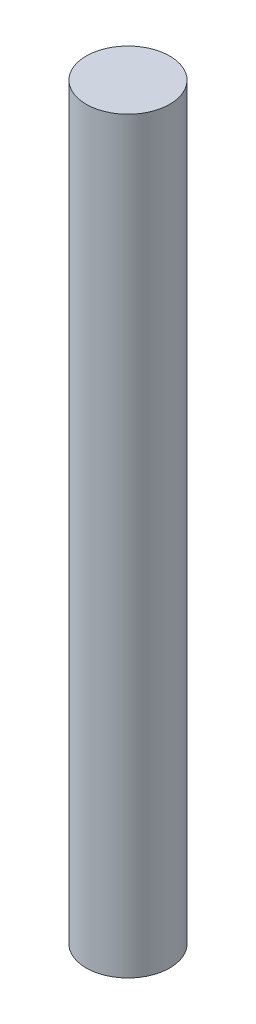
ISO-10303-21;
HEADER;
FILE_DESCRIPTION(('STEP AP214'),'2;1');
FILE_NAME('part.step','',(''),(''),'','','');
FILE_SCHEMA(('AUTOMOTIVE_DESIGN { 1 0 10303 214 1 1 1 1 }'));
ENDSEC;
DATA;
#1=APPLICATION_CONTEXT('core data for automotive mechanical design processes');
#2=APPLICATION_PROTOCOL_DEFINITION('international standard','automotive_design',2000,#1);
#3=PRODUCT_CONTEXT('',#1,'mechanical');
#4=PRODUCT('Part','Part','',(#3));
#5=PRODUCT_RELATED_PRODUCT_CATEGORY('part','',(#4));
#6=PRODUCT_DEFINITION_FORMATION('','',#4);
#7=PRODUCT_DEFINITION_CONTEXT('part definition',#1,'design');
#8=PRODUCT_DEFINITION('design','',#6,#7);
#9=PRODUCT_DEFINITION_SHAPE('','',#8);
#10=(LENGTH_UNIT() NAMED_UNIT(*) SI_UNIT(.MILLI.,.METRE.));
#11=(NAMED_UNIT(*) PLANE_ANGLE_UNIT() SI_UNIT($,.RADIAN.));
#12=(NAMED_UNIT(*) SI_UNIT($,.STERADIAN.) SOLID_ANGLE_UNIT());
#13=UNCERTAINTY_MEASURE_WITH_UNIT(LENGTH_MEASURE(1.E-05),#10,'distance_accuracy_value','');
#14=(GEOMETRIC_REPRESENTATION_CONTEXT(3) GLOBAL_UNCERTAINTY_ASSIGNED_CONTEXT((#13)) GLOBAL_UNIT_ASSIGNED_CONTEXT((#10,
#11,#12)) REPRESENTATION_CONTEXT('',''));
#15=CARTESIAN_POINT('',(0.,0.,0.));
#16=DIRECTION('',(0.,0.,1.));
#17=DIRECTION('',(1.,0.,0.));
#18=AXIS2_PLACEMENT_3D('',#15,#16,#17);
#19=CARTESIAN_POINT('',(0.,34.,0.));
#20=DIRECTION('',(0.,-1.,0.));
#21=DIRECTION('',(0.,0.,-1.));
#22=AXIS2_PLACEMENT_3D('',#19,#20,#21);
#23=CYLINDRICAL_SURFACE('',#22,1.9);
#24=CARTESIAN_POINT('',(0.,34.,0.));
#25=DIRECTION('',(0.,1.,0.));
#26=DIRECTION('',(0.,0.,1.));
#27=AXIS2_PLACEMENT_3D('',#24,#25,#26);
#28=CIRCLE('',#27,1.9);
#29=CARTESIAN_POINT('',(0.,34.,1.9));
#30=VERTEX_POINT('',#29);
#31=EDGE_CURVE('E10',#30,#30,#28,.T.);
#32=ORIENTED_EDGE('',*,*,#31,.F.);
#33=EDGE_LOOP('',(#32));
#34=FACE_BOUND('',#33,.T.);
#35=CARTESIAN_POINT('',(0.,0.,0.));
#36=DIRECTION('',(0.,1.,0.));
#37=DIRECTION('',(0.,0.,1.));
#38=AXIS2_PLACEMENT_3D('',#35,#36,#37);
#39=CIRCLE('',#38,1.9);
#40=CARTESIAN_POINT('',(0.,0.,1.9));
#41=VERTEX_POINT('',#40);
#42=EDGE_CURVE('E36',#41,#41,#39,.T.);
#43=ORIENTED_EDGE('',*,*,#42,.T.);
#44=EDGE_LOOP('',(#43));
#45=FACE_BOUND('',#44,.T.);
#46=ADVANCED_FACE('F33',(#34,#45),#23,.T.);
#47=CARTESIAN_POINT('',(0.,34.,0.));
#48=DIRECTION('',(0.,1.,0.));
#49=DIRECTION('',(0.,0.,1.));
#50=AXIS2_PLACEMENT_3D('',#47,#48,#49);
#51=PLANE('',#50);
#52=ORIENTED_EDGE('',*,*,#31,.T.);
#53=EDGE_LOOP('',(#52));
#54=FACE_BOUND('',#53,.T.);
#55=ADVANCED_FACE('F48',(#54),#51,.T.);
#56=CARTESIAN_POINT('',(0.,0.,0.));
#57=DIRECTION('',(0.,1.,0.));
#58=DIRECTION('',(0.,0.,1.));
#59=AXIS2_PLACEMENT_3D('',#56,#57,#58);
#60=PLANE('',#59);
#61=ORIENTED_EDGE('',*,*,#42,.F.);
#62=EDGE_LOOP('',(#61));
#63=FACE_BOUND('',#62,.T.);
#64=ADVANCED_FACE('F46',(#63),#60,.F.);
#65=CLOSED_SHELL('',(#46,#55,#64));
#66=MANIFOLD_SOLID_BREP('B2',#65);
#67=ADVANCED_BREP_SHAPE_REPRESENTATION('',(#18,#66),#14);
#68=SHAPE_DEFINITION_REPRESENTATION(#9,#67);
ENDSEC;
END-ISO-10303-21;
